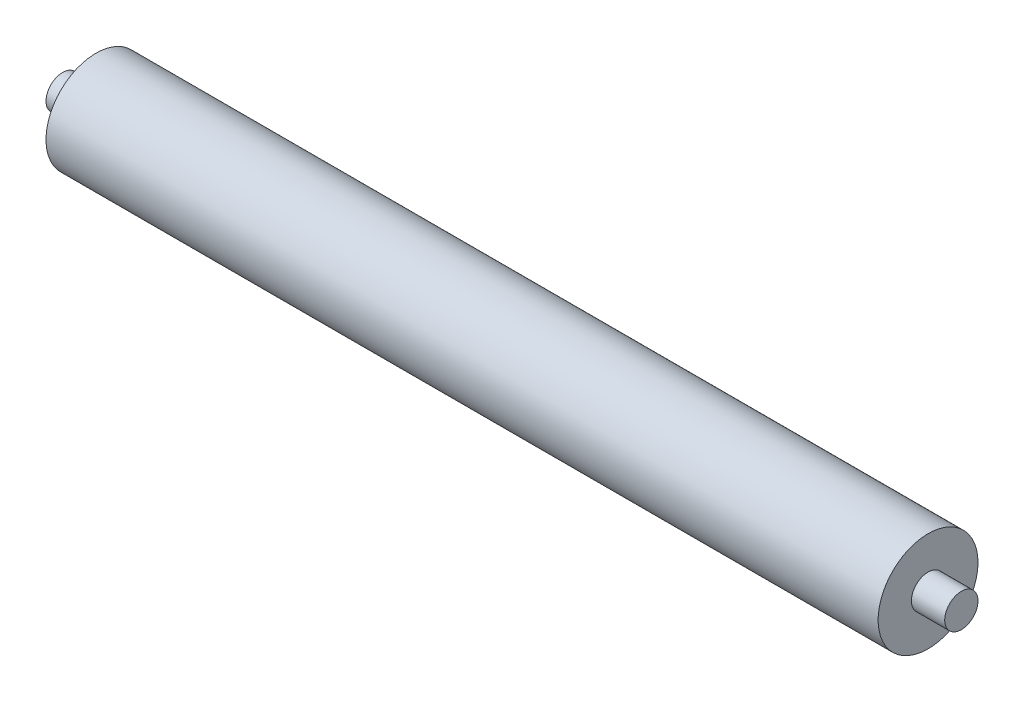
ISO-10303-21;
HEADER;
FILE_DESCRIPTION(('STEP AP214'),'2;1');
FILE_NAME('part.step','',(''),(''),'','','');
FILE_SCHEMA(('AUTOMOTIVE_DESIGN { 1 0 10303 214 1 1 1 1 }'));
ENDSEC;
DATA;
#1=APPLICATION_CONTEXT('core data for automotive mechanical design processes');
#2=APPLICATION_PROTOCOL_DEFINITION('international standard','automotive_design',2000,#1);
#3=PRODUCT_CONTEXT('',#1,'mechanical');
#4=PRODUCT('Part','Part','',(#3));
#5=PRODUCT_RELATED_PRODUCT_CATEGORY('part','',(#4));
#6=PRODUCT_DEFINITION_FORMATION('','',#4);
#7=PRODUCT_DEFINITION_CONTEXT('part definition',#1,'design');
#8=PRODUCT_DEFINITION('design','',#6,#7);
#9=PRODUCT_DEFINITION_SHAPE('','',#8);
#10=(LENGTH_UNIT() NAMED_UNIT(*) SI_UNIT(.MILLI.,.METRE.));
#11=(NAMED_UNIT(*) PLANE_ANGLE_UNIT() SI_UNIT($,.RADIAN.));
#12=(NAMED_UNIT(*) SI_UNIT($,.STERADIAN.) SOLID_ANGLE_UNIT());
#13=UNCERTAINTY_MEASURE_WITH_UNIT(LENGTH_MEASURE(1.E-05),#10,'distance_accuracy_value','');
#14=(GEOMETRIC_REPRESENTATION_CONTEXT(3) GLOBAL_UNCERTAINTY_ASSIGNED_CONTEXT((#13)) GLOBAL_UNIT_ASSIGNED_CONTEXT((#10,
#11,#12)) REPRESENTATION_CONTEXT('',''));
#15=CARTESIAN_POINT('',(0.,0.,0.));
#16=DIRECTION('',(0.,0.,1.));
#17=DIRECTION('',(1.,0.,0.));
#18=AXIS2_PLACEMENT_3D('',#15,#16,#17);
#19=CARTESIAN_POINT('',(0.,0.,0.));
#20=DIRECTION('',(1.,0.,0.));
#21=DIRECTION('',(0.,0.,-1.));
#22=AXIS2_PLACEMENT_3D('',#19,#20,#21);
#23=PLANE('',#22);
#24=CARTESIAN_POINT('',(0.,0.,0.));
#25=DIRECTION('',(1.,0.,0.));
#26=DIRECTION('',(0.,0.,-1.));
#27=AXIS2_PLACEMENT_3D('',#24,#25,#26);
#28=CIRCLE('',#27,1.5);
#29=CARTESIAN_POINT('',(0.,0.,-1.5));
#30=VERTEX_POINT('',#29);
#31=EDGE_CURVE('E41',#30,#30,#28,.T.);
#32=ORIENTED_EDGE('',*,*,#31,.F.);
#33=EDGE_LOOP('',(#32));
#34=FACE_BOUND('',#33,.T.);
#35=CARTESIAN_POINT('',(0.,0.,0.));
#36=DIRECTION('',(1.,0.,0.));
#37=DIRECTION('',(0.,0.,-1.));
#38=AXIS2_PLACEMENT_3D('',#35,#36,#37);
#39=CIRCLE('',#38,0.5);
#40=CARTESIAN_POINT('',(0.,0.,-0.5));
#41=VERTEX_POINT('',#40);
#42=EDGE_CURVE('E10',#41,#41,#39,.F.);
#43=ORIENTED_EDGE('',*,*,#42,.F.);
#44=EDGE_LOOP('',(#43));
#45=FACE_BOUND('',#44,.T.);
#46=ADVANCED_FACE('F30',(#34,#45),#23,.F.);
#47=CARTESIAN_POINT('',(25.,0.,0.));
#48=DIRECTION('',(1.,0.,0.));
#49=DIRECTION('',(0.,0.,-1.));
#50=AXIS2_PLACEMENT_3D('',#47,#48,#49);
#51=PLANE('',#50);
#52=CARTESIAN_POINT('',(25.,0.,0.));
#53=DIRECTION('',(1.,0.,0.));
#54=DIRECTION('',(0.,0.,-1.));
#55=AXIS2_PLACEMENT_3D('',#52,#53,#54);
#56=CIRCLE('',#55,1.5);
#57=CARTESIAN_POINT('',(25.,0.,-1.5));
#58=VERTEX_POINT('',#57);
#59=EDGE_CURVE('E37',#58,#58,#56,.T.);
#60=ORIENTED_EDGE('',*,*,#59,.T.);
#61=EDGE_LOOP('',(#60));
#62=FACE_BOUND('',#61,.T.);
#63=CARTESIAN_POINT('',(25.,0.,0.));
#64=DIRECTION('',(1.,0.,0.));
#65=DIRECTION('',(0.,0.,-1.));
#66=AXIS2_PLACEMENT_3D('',#63,#64,#65);
#67=CIRCLE('',#66,0.5);
#68=CARTESIAN_POINT('',(25.,0.,-0.5));
#69=VERTEX_POINT('',#68);
#70=EDGE_CURVE('E48',#69,#69,#67,.T.);
#71=ORIENTED_EDGE('',*,*,#70,.F.);
#72=EDGE_LOOP('',(#71));
#73=FACE_BOUND('',#72,.T.);
#74=ADVANCED_FACE('F72',(#62,#73),#51,.T.);
#75=CARTESIAN_POINT('',(25.,0.,0.));
#76=DIRECTION('',(-1.,0.,0.));
#77=DIRECTION('',(0.,0.,1.));
#78=AXIS2_PLACEMENT_3D('',#75,#76,#77);
#79=CYLINDRICAL_SURFACE('',#78,1.5);
#80=ORIENTED_EDGE('',*,*,#59,.F.);
#81=EDGE_LOOP('',(#80));
#82=FACE_BOUND('',#81,.T.);
#83=ORIENTED_EDGE('',*,*,#31,.T.);
#84=EDGE_LOOP('',(#83));
#85=FACE_BOUND('',#84,.T.);
#86=ADVANCED_FACE('F32',(#82,#85),#79,.T.);
#87=CARTESIAN_POINT('',(26.,0.,0.));
#88=DIRECTION('',(-1.,0.,0.));
#89=DIRECTION('',(0.,0.,1.));
#90=AXIS2_PLACEMENT_3D('',#87,#88,#89);
#91=CYLINDRICAL_SURFACE('',#90,0.5);
#92=CARTESIAN_POINT('',(26.,0.,0.));
#93=DIRECTION('',(1.,0.,0.));
#94=DIRECTION('',(0.,0.,-1.));
#95=AXIS2_PLACEMENT_3D('',#92,#93,#94);
#96=CIRCLE('',#95,0.5);
#97=CARTESIAN_POINT('',(26.,0.,-0.5));
#98=VERTEX_POINT('',#97);
#99=EDGE_CURVE('E46',#98,#98,#96,.T.);
#100=ORIENTED_EDGE('',*,*,#99,.F.);
#101=EDGE_LOOP('',(#100));
#102=FACE_BOUND('',#101,.T.);
#103=ORIENTED_EDGE('',*,*,#70,.T.);
#104=EDGE_LOOP('',(#103));
#105=FACE_BOUND('',#104,.T.);
#106=ADVANCED_FACE('F68',(#102,#105),#91,.T.);
#107=CARTESIAN_POINT('',(26.,0.,0.));
#108=DIRECTION('',(1.,0.,0.));
#109=DIRECTION('',(0.,0.,-1.));
#110=AXIS2_PLACEMENT_3D('',#107,#108,#109);
#111=PLANE('',#110);
#112=ORIENTED_EDGE('',*,*,#99,.T.);
#113=EDGE_LOOP('',(#112));
#114=FACE_BOUND('',#113,.T.);
#115=ADVANCED_FACE('F61',(#114),#111,.T.);
#116=CARTESIAN_POINT('',(-1.,0.,0.));
#117=DIRECTION('',(1.,0.,0.));
#118=DIRECTION('',(0.,0.,-1.));
#119=AXIS2_PLACEMENT_3D('',#116,#117,#118);
#120=CYLINDRICAL_SURFACE('',#119,0.5);
#121=CARTESIAN_POINT('',(-1.,0.,0.));
#122=DIRECTION('',(-1.,0.,0.));
#123=DIRECTION('',(0.,0.,1.));
#124=AXIS2_PLACEMENT_3D('',#121,#122,#123);
#125=CIRCLE('',#124,0.5);
#126=CARTESIAN_POINT('',(-1.,0.,0.5));
#127=VERTEX_POINT('',#126);
#128=EDGE_CURVE('E51',#127,#127,#125,.T.);
#129=ORIENTED_EDGE('',*,*,#128,.F.);
#130=EDGE_LOOP('',(#129));
#131=FACE_BOUND('',#130,.T.);
#132=ORIENTED_EDGE('',*,*,#42,.T.);
#133=EDGE_LOOP('',(#132));
#134=FACE_BOUND('',#133,.T.);
#135=ADVANCED_FACE('F59',(#131,#134),#120,.T.);
#136=CARTESIAN_POINT('',(-1.,0.,0.));
#137=DIRECTION('',(-1.,0.,0.));
#138=DIRECTION('',(0.,0.,1.));
#139=AXIS2_PLACEMENT_3D('',#136,#137,#138);
#140=PLANE('',#139);
#141=ORIENTED_EDGE('',*,*,#128,.T.);
#142=EDGE_LOOP('',(#141));
#143=FACE_BOUND('',#142,.T.);
#144=ADVANCED_FACE('F57',(#143),#140,.T.);
#145=CLOSED_SHELL('',(#46,#74,#86,#106,#115,#135,#144));
#146=MANIFOLD_SOLID_BREP('B2',#145);
#147=ADVANCED_BREP_SHAPE_REPRESENTATION('',(#18,#146),#14);
#148=SHAPE_DEFINITION_REPRESENTATION(#9,#147);
ENDSEC;
END-ISO-10303-21;
